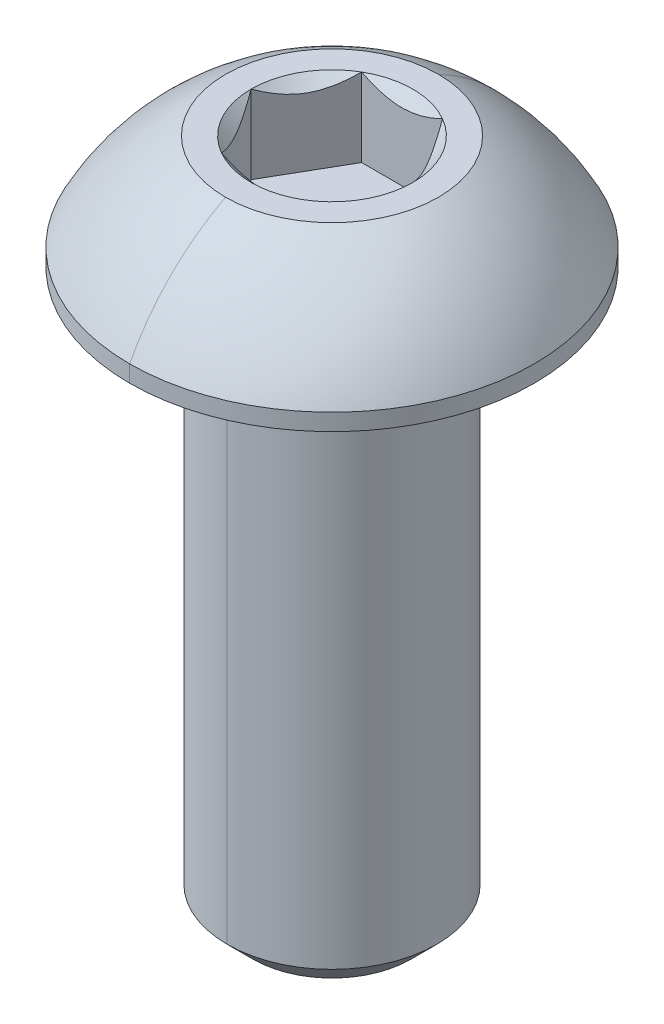
ISO-10303-21;
HEADER;
FILE_DESCRIPTION(('STEP AP214'),'2;1');
FILE_NAME('part.step','',(''),(''),'','','');
FILE_SCHEMA(('AUTOMOTIVE_DESIGN { 1 0 10303 214 1 1 1 1 }'));
ENDSEC;
DATA;
#1=APPLICATION_CONTEXT('core data for automotive mechanical design processes');
#2=APPLICATION_PROTOCOL_DEFINITION('international standard','automotive_design',2000,#1);
#3=PRODUCT_CONTEXT('',#1,'mechanical');
#4=PRODUCT('Part','Part','',(#3));
#5=PRODUCT_RELATED_PRODUCT_CATEGORY('part','',(#4));
#6=PRODUCT_DEFINITION_FORMATION('','',#4);
#7=PRODUCT_DEFINITION_CONTEXT('part definition',#1,'design');
#8=PRODUCT_DEFINITION('design','',#6,#7);
#9=PRODUCT_DEFINITION_SHAPE('','',#8);
#10=(LENGTH_UNIT() NAMED_UNIT(*) SI_UNIT(.MILLI.,.METRE.));
#11=(NAMED_UNIT(*) PLANE_ANGLE_UNIT() SI_UNIT($,.RADIAN.));
#12=(NAMED_UNIT(*) SI_UNIT($,.STERADIAN.) SOLID_ANGLE_UNIT());
#13=UNCERTAINTY_MEASURE_WITH_UNIT(LENGTH_MEASURE(1.E-05),#10,'distance_accuracy_value','');
#14=(GEOMETRIC_REPRESENTATION_CONTEXT(3) GLOBAL_UNCERTAINTY_ASSIGNED_CONTEXT((#13)) GLOBAL_UNIT_ASSIGNED_CONTEXT((#10,
#11,#12)) REPRESENTATION_CONTEXT('',''));
#15=CARTESIAN_POINT('',(0.,0.,0.));
#16=DIRECTION('',(0.,0.,1.));
#17=DIRECTION('',(1.,0.,0.));
#18=AXIS2_PLACEMENT_3D('',#15,#16,#17);
#19=CARTESIAN_POINT('',(0.,-0.1524,0.));
#20=DIRECTION('',(0.,1.,0.));
#21=DIRECTION('',(0.,0.,1.));
#22=AXIS2_PLACEMENT_3D('',#19,#20,#21);
#23=TOROIDAL_SURFACE('',#22,2.5273,0.1524);
#24=CARTESIAN_POINT('',(0.,-0.1524,-2.5273));
#25=DIRECTION('',(1.,0.,0.));
#26=DIRECTION('',(0.,0.,-1.));
#27=AXIS2_PLACEMENT_3D('',#24,#25,#26);
#28=CIRCLE('',#27,0.1524);
#29=CARTESIAN_POINT('',(0.,0.,-2.5273));
#30=VERTEX_POINT('',#29);
#31=CARTESIAN_POINT('',(0.,-0.1524,-2.3749));
#32=VERTEX_POINT('',#31);
#33=EDGE_CURVE('E328',#30,#32,#28,.T.);
#34=ORIENTED_EDGE('',*,*,#33,.F.);
#35=CARTESIAN_POINT('',(0.,0.,0.));
#36=DIRECTION('',(0.,1.,0.));
#37=DIRECTION('',(0.,0.,1.));
#38=AXIS2_PLACEMENT_3D('',#35,#36,#37);
#39=CIRCLE('',#38,2.5273);
#40=CARTESIAN_POINT('',(0.,0.,2.5273));
#41=VERTEX_POINT('',#40);
#42=EDGE_CURVE('E325',#41,#30,#39,.T.);
#43=ORIENTED_EDGE('',*,*,#42,.F.);
#44=CARTESIAN_POINT('',(0.,-0.1524,2.5273));
#45=DIRECTION('',(-1.,0.,0.));
#46=DIRECTION('',(0.,0.,1.));
#47=AXIS2_PLACEMENT_3D('',#44,#45,#46);
#48=CIRCLE('',#47,0.1524);
#49=CARTESIAN_POINT('',(0.,-0.1524,2.3749));
#50=VERTEX_POINT('',#49);
#51=EDGE_CURVE('E310',#41,#50,#48,.T.);
#52=ORIENTED_EDGE('',*,*,#51,.T.);
#53=CARTESIAN_POINT('',(0.,-0.1524,0.));
#54=DIRECTION('',(0.,-1.,0.));
#55=DIRECTION('',(0.,0.,1.));
#56=AXIS2_PLACEMENT_3D('',#53,#54,#55);
#57=CIRCLE('',#56,2.3749);
#58=EDGE_CURVE('E305',#32,#50,#57,.T.);
#59=ORIENTED_EDGE('',*,*,#58,.F.);
#60=EDGE_LOOP('',(#34,#43,#52,#59));
#61=FACE_BOUND('',#60,.T.);
#62=ADVANCED_FACE('F16',(#61),#23,.F.);
#63=CARTESIAN_POINT('',(0.,2.5654,0.));
#64=DIRECTION('',(0.,1.,0.));
#65=DIRECTION('',(0.,0.,1.));
#66=AXIS2_PLACEMENT_3D('',#63,#64,#65);
#67=CONICAL_SURFACE('',#66,1.83308710467706,0.78539816339745);
#68=DIRECTION('',(0.,0.707106781186546,-0.707106781186549));
#69=VECTOR('',#68,1.);
#70=CARTESIAN_POINT('',(0.,2.5654,-1.83308710467706));
#71=LINE('',#70,#69);
#72=CARTESIAN_POINT('',(0.,0.732312895322944,0.));
#73=VERTEX_POINT('',#72);
#74=CARTESIAN_POINT('',(0.,0.7874,-0.0550871046770556));
#75=VERTEX_POINT('',#74);
#76=EDGE_CURVE('E134',#73,#75,#71,.T.);
#77=ORIENTED_EDGE('',*,*,#76,.F.);
#78=DIRECTION('',(0.,0.707106781186546,0.707106781186549));
#79=VECTOR('',#78,1.);
#80=CARTESIAN_POINT('',(0.,2.5654,1.83308710467706));
#81=LINE('',#80,#79);
#82=CARTESIAN_POINT('',(0.,0.7874,0.0550871046770556));
#83=VERTEX_POINT('',#82);
#84=EDGE_CURVE('E277',#73,#83,#81,.T.);
#85=ORIENTED_EDGE('',*,*,#84,.T.);
#86=CARTESIAN_POINT('',(0.,0.7874,0.));
#87=DIRECTION('',(0.,1.,0.));
#88=DIRECTION('',(0.,0.,1.));
#89=AXIS2_PLACEMENT_3D('',#86,#87,#88);
#90=CIRCLE('',#89,0.0550871046770558);
#91=EDGE_CURVE('E114',#83,#75,#90,.T.);
#92=ORIENTED_EDGE('',*,*,#91,.T.);
#93=EDGE_LOOP('',(#77,#85,#92));
#94=FACE_BOUND('',#93,.T.);
#95=ADVANCED_FACE('F224',(#94),#67,.F.);
#96=CARTESIAN_POINT('',(1.83308710467706,0.7874,0.));
#97=DIRECTION('',(0.866025403784439,0.,-0.5));
#98=DIRECTION('',(0.,-1.,0.));
#99=AXIS2_PLACEMENT_3D('',#96,#97,#98);
#100=PLANE('',#99);
#101=DIRECTION('',(0.,1.,0.));
#102=VECTOR('',#101,1.);
#103=CARTESIAN_POINT('',(1.83308710467706,0.7874,0.));
#104=LINE('',#103,#102);
#105=CARTESIAN_POINT('',(1.83308710467706,0.7874,0.));
#106=VERTEX_POINT('',#105);
#107=CARTESIAN_POINT('',(1.83308710467706,2.5654,0.));
#108=VERTEX_POINT('',#107);
#109=EDGE_CURVE('E11',#106,#108,#104,.T.);
#110=ORIENTED_EDGE('',*,*,#109,.T.);
#111=CARTESIAN_POINT('',(1.83308710467706,2.5654,0.));
#112=CARTESIAN_POINT('',(1.58854939316106,2.32086228848399,-0.423551740712339));
#113=CARTESIAN_POINT('',(1.37650342717985,2.31981648546325,-0.790826127331817));
#114=CARTESIAN_POINT('',(1.16317917435944,2.31876437797812,-1.16031457170343));
#115=CARTESIAN_POINT('',(0.91654355233853,2.5654,-1.5875));
#116=B_SPLINE_CURVE_WITH_KNOTS('',2,(#111,#112,#113,#114,#115),.UNSPECIFIED.,.F.,.F.,(3,2,3),
(0.,0.5,1.),.UNSPECIFIED.);
#117=CARTESIAN_POINT('',(0.916543552338531,2.5654,-1.5875));
#118=VERTEX_POINT('',#117);
#119=EDGE_CURVE('E206',#108,#118,#116,.T.);
#120=ORIENTED_EDGE('',*,*,#119,.T.);
#121=DIRECTION('',(0.,1.,0.));
#122=VECTOR('',#121,1.);
#123=CARTESIAN_POINT('',(0.916543552338531,0.7874,-1.5875));
#124=LINE('',#123,#122);
#125=CARTESIAN_POINT('',(0.916543552338531,0.7874,-1.5875));
#126=VERTEX_POINT('',#125);
#127=EDGE_CURVE('E513',#126,#118,#124,.T.);
#128=ORIENTED_EDGE('',*,*,#127,.F.);
#129=DIRECTION('',(-0.5,0.,-0.866025403784439));
#130=VECTOR('',#129,1.);
#131=CARTESIAN_POINT('',(1.83308710467706,0.7874,0.));
#132=LINE('',#131,#130);
#133=EDGE_CURVE('E364',#106,#126,#132,.T.);
#134=ORIENTED_EDGE('',*,*,#133,.F.);
#135=EDGE_LOOP('',(#110,#120,#128,#134));
#136=FACE_BOUND('',#135,.T.);
#137=ADVANCED_FACE('F213',(#136),#100,.F.);
#138=CARTESIAN_POINT('',(0.916543552338531,0.7874,1.5875));
#139=DIRECTION('',(0.866025403784439,0.,0.5));
#140=DIRECTION('',(0.,-1.,0.));
#141=AXIS2_PLACEMENT_3D('',#138,#139,#140);
#142=PLANE('',#141);
#143=DIRECTION('',(0.,1.,0.));
#144=VECTOR('',#143,1.);
#145=CARTESIAN_POINT('',(0.916543552338531,0.7874,1.5875));
#146=LINE('',#145,#144);
#147=CARTESIAN_POINT('',(0.916543552338531,0.7874,1.5875));
#148=VERTEX_POINT('',#147);
#149=CARTESIAN_POINT('',(0.916543552338531,2.5654,1.5875));
#150=VERTEX_POINT('',#149);
#151=EDGE_CURVE('E30',#148,#150,#146,.T.);
#152=ORIENTED_EDGE('',*,*,#151,.T.);
#153=CARTESIAN_POINT('',(0.916543552338531,2.5654,1.5875));
#154=CARTESIAN_POINT('',(1.16108126385472,2.32086228848382,1.16394825928734));
#155=CARTESIAN_POINT('',(1.37312722983574,2.31981648546325,0.796673872668184));
#156=CARTESIAN_POINT('',(1.58645148265633,2.3187643779783,0.427185428296259));
#157=CARTESIAN_POINT('',(1.83308710467706,2.5654,0.));
#158=B_SPLINE_CURVE_WITH_KNOTS('',2,(#153,#154,#155,#156,#157),.UNSPECIFIED.,.F.,.F.,(3,2,3),
(0.,0.5,1.),.UNSPECIFIED.);
#159=EDGE_CURVE('E464',#150,#108,#158,.T.);
#160=ORIENTED_EDGE('',*,*,#159,.T.);
#161=ORIENTED_EDGE('',*,*,#109,.F.);
#162=DIRECTION('',(0.5,0.,-0.866025403784439));
#163=VECTOR('',#162,1.);
#164=CARTESIAN_POINT('',(0.916543552338531,0.7874,1.5875));
#165=LINE('',#164,#163);
#166=EDGE_CURVE('E199',#148,#106,#165,.T.);
#167=ORIENTED_EDGE('',*,*,#166,.F.);
#168=EDGE_LOOP('',(#152,#160,#161,#167));
#169=FACE_BOUND('',#168,.T.);
#170=ADVANCED_FACE('F223',(#169),#142,.F.);
#171=CARTESIAN_POINT('',(-0.91654355233853,0.7874,1.5875));
#172=DIRECTION('',(0.,0.,1.));
#173=DIRECTION('',(1.,0.,0.));
#174=AXIS2_PLACEMENT_3D('',#171,#172,#173);
#175=PLANE('',#174);
#176=DIRECTION('',(0.,1.,0.));
#177=VECTOR('',#176,1.);
#178=CARTESIAN_POINT('',(-0.91654355233853,0.7874,1.5875));
#179=LINE('',#178,#177);
#180=CARTESIAN_POINT('',(-0.91654355233853,0.7874,1.5875));
#181=VERTEX_POINT('',#180);
#182=CARTESIAN_POINT('',(-0.91654355233853,2.5654,1.5875));
#183=VERTEX_POINT('',#182);
#184=EDGE_CURVE('E606',#181,#183,#179,.T.);
#185=ORIENTED_EDGE('',*,*,#184,.T.);
#186=CARTESIAN_POINT('',(-0.916543552338531,2.5654,1.5875));
#187=CARTESIAN_POINT('',(-0.684381010738564,2.44931872920002,1.5875));
#188=CARTESIAN_POINT('',(-0.4718738638875,2.38845938444161,1.5875));
#189=CARTESIAN_POINT('',(-0.232175759974894,2.31981289532294,1.5875));
#190=CARTESIAN_POINT('',(0.,2.31981289532294,1.5875));
#191=B_SPLINE_CURVE_WITH_KNOTS('',2,(#186,#187,#188,#189,#190),.UNSPECIFIED.,.F.,.F.,(3,2,3),
(0.,0.5,1.),.UNSPECIFIED.);
#192=CARTESIAN_POINT('',(0.,2.31981289532294,1.5875));
#193=VERTEX_POINT('',#192);
#194=EDGE_CURVE('E661',#183,#193,#191,.T.);
#195=ORIENTED_EDGE('',*,*,#194,.T.);
#196=CARTESIAN_POINT('',(0.,2.31981289532294,1.5875));
#197=CARTESIAN_POINT('',(0.229732695645398,2.31981289532294,1.5875));
#198=CARTESIAN_POINT('',(0.471961624215038,2.3884843914945,1.5875));
#199=CARTESIAN_POINT('',(0.68154594324368,2.44790119545257,1.5875));
#200=CARTESIAN_POINT('',(0.91654355233853,2.5654,1.5875));
#201=B_SPLINE_CURVE_WITH_KNOTS('',2,(#196,#197,#198,#199,#200),.UNSPECIFIED.,.F.,.F.,(3,2,3),
(0.,0.5,1.),.UNSPECIFIED.);
#202=EDGE_CURVE('E249',#193,#150,#201,.T.);
#203=ORIENTED_EDGE('',*,*,#202,.T.);
#204=ORIENTED_EDGE('',*,*,#151,.F.);
#205=DIRECTION('',(1.,0.,0.));
#206=VECTOR('',#205,1.);
#207=CARTESIAN_POINT('',(-0.91654355233853,0.7874,1.5875));
#208=LINE('',#207,#206);
#209=EDGE_CURVE('E282',#181,#148,#208,.T.);
#210=ORIENTED_EDGE('',*,*,#209,.F.);
#211=EDGE_LOOP('',(#185,#195,#203,#204,#210));
#212=FACE_BOUND('',#211,.T.);
#213=ADVANCED_FACE('F18',(#212),#175,.F.);
#214=CARTESIAN_POINT('',(-1.83308710467706,0.7874,0.));
#215=DIRECTION('',(-0.866025403784439,0.,0.5));
#216=DIRECTION('',(0.,1.,0.));
#217=AXIS2_PLACEMENT_3D('',#214,#215,#216);
#218=PLANE('',#217);
#219=DIRECTION('',(0.,1.,0.));
#220=VECTOR('',#219,1.);
#221=CARTESIAN_POINT('',(-1.83308710467706,0.7874,0.));
#222=LINE('',#221,#220);
#223=CARTESIAN_POINT('',(-1.83308710467706,0.7874,0.));
#224=VERTEX_POINT('',#223);
#225=CARTESIAN_POINT('',(-1.83308710467706,2.5654,0.));
#226=VERTEX_POINT('',#225);
#227=EDGE_CURVE('E576',#224,#226,#222,.T.);
#228=ORIENTED_EDGE('',*,*,#227,.T.);
#229=CARTESIAN_POINT('',(-1.83308710467706,2.5654,0.));
#230=CARTESIAN_POINT('',(-1.58854939316106,2.32086228848399,0.423551740712331));
#231=CARTESIAN_POINT('',(-1.37650342717985,2.31981648546325,0.790826127331817));
#232=CARTESIAN_POINT('',(-1.16317917435944,2.31876437797812,1.16031457170343));
#233=CARTESIAN_POINT('',(-0.91654355233853,2.5654,1.5875));
#234=B_SPLINE_CURVE_WITH_KNOTS('',2,(#229,#230,#231,#232,#233),.UNSPECIFIED.,.F.,.F.,(3,2,3),
(0.,0.5,1.),.UNSPECIFIED.);
#235=EDGE_CURVE('E579',#226,#183,#234,.T.);
#236=ORIENTED_EDGE('',*,*,#235,.T.);
#237=ORIENTED_EDGE('',*,*,#184,.F.);
#238=DIRECTION('',(0.5,0.,0.866025403784438));
#239=VECTOR('',#238,1.);
#240=CARTESIAN_POINT('',(-1.83308710467706,0.7874,0.));
#241=LINE('',#240,#239);
#242=EDGE_CURVE('E285',#224,#181,#241,.T.);
#243=ORIENTED_EDGE('',*,*,#242,.F.);
#244=EDGE_LOOP('',(#228,#236,#237,#243));
#245=FACE_BOUND('',#244,.T.);
#246=ADVANCED_FACE('F233',(#245),#218,.F.);
#247=CARTESIAN_POINT('',(-0.916543552338531,0.7874,-1.5875));
#248=DIRECTION('',(-0.866025403784439,0.,-0.5));
#249=DIRECTION('',(-0.5,0.,0.866025403784439));
#250=AXIS2_PLACEMENT_3D('',#247,#248,#249);
#251=PLANE('',#250);
#252=DIRECTION('',(0.,1.,0.));
#253=VECTOR('',#252,1.);
#254=CARTESIAN_POINT('',(-0.916543552338531,0.7874,-1.5875));
#255=LINE('',#254,#253);
#256=CARTESIAN_POINT('',(-0.916543552338531,0.7874,-1.5875));
#257=VERTEX_POINT('',#256);
#258=CARTESIAN_POINT('',(-0.916543552338531,2.5654,-1.5875));
#259=VERTEX_POINT('',#258);
#260=EDGE_CURVE('E516',#257,#259,#255,.T.);
#261=ORIENTED_EDGE('',*,*,#260,.T.);
#262=CARTESIAN_POINT('',(-0.916543552338531,2.5654,-1.5875));
#263=CARTESIAN_POINT('',(-1.16108126385453,2.320862288484,-1.16394825928767));
#264=CARTESIAN_POINT('',(-1.37312722983574,2.31981648546325,-0.796673872668183));
#265=CARTESIAN_POINT('',(-1.58645148265615,2.31876437797813,-0.427185428296571));
#266=CARTESIAN_POINT('',(-1.83308710467706,2.5654,0.));
#267=B_SPLINE_CURVE_WITH_KNOTS('',2,(#262,#263,#264,#265,#266),.UNSPECIFIED.,.F.,.F.,(3,2,3),
(0.,0.5,1.),.UNSPECIFIED.);
#268=EDGE_CURVE('E543',#259,#226,#267,.T.);
#269=ORIENTED_EDGE('',*,*,#268,.T.);
#270=ORIENTED_EDGE('',*,*,#227,.F.);
#271=DIRECTION('',(-0.5,0.,0.866025403784439));
#272=VECTOR('',#271,1.);
#273=CARTESIAN_POINT('',(-0.916543552338531,0.7874,-1.5875));
#274=LINE('',#273,#272);
#275=EDGE_CURVE('E293',#257,#224,#274,.T.);
#276=ORIENTED_EDGE('',*,*,#275,.F.);
#277=EDGE_LOOP('',(#261,#269,#270,#276));
#278=FACE_BOUND('',#277,.T.);
#279=ADVANCED_FACE('F558',(#278),#251,.F.);
#280=CARTESIAN_POINT('',(0.916543552338531,0.7874,-1.5875));
#281=DIRECTION('',(0.,0.,-1.));
#282=DIRECTION('',(-1.,0.,0.));
#283=AXIS2_PLACEMENT_3D('',#280,#281,#282);
#284=PLANE('',#283);
#285=ORIENTED_EDGE('',*,*,#127,.T.);
#286=CARTESIAN_POINT('',(0.916543552338531,2.5654,-1.5875));
#287=CARTESIAN_POINT('',(0.68330023814449,2.44877834290298,-1.5875));
#288=CARTESIAN_POINT('',(0.472022049766507,2.38850161206546,-1.5875));
#289=CARTESIAN_POINT('',(0.231606862063275,2.31991222444484,-1.5875));
#290=CARTESIAN_POINT('',(0.000126990617285933,2.31981290040219,-1.5875));
#291=CARTESIAN_POINT('',(-0.230319895797069,2.3197140195957,-1.5875));
#292=CARTESIAN_POINT('',(-0.471813597713689,2.38844221424328,-1.5875));
#293=CARTESIAN_POINT('',(-0.682613944360854,2.44843519601116,-1.5875));
#294=CARTESIAN_POINT('',(-0.916543552338529,2.5654,-1.5875));
#295=B_SPLINE_CURVE_WITH_KNOTS('',2,(#286,#287,#288,#289,#290,#291,#292,#293,#294),
.UNSPECIFIED.,.F.,.F.,(3,2,2,2,3),(0.,0.25,0.5,0.75,1.),.UNSPECIFIED.);
#296=EDGE_CURVE('E526',#118,#259,#295,.T.);
#297=ORIENTED_EDGE('',*,*,#296,.T.);
#298=ORIENTED_EDGE('',*,*,#260,.F.);
#299=DIRECTION('',(-1.,0.,0.));
#300=VECTOR('',#299,1.);
#301=CARTESIAN_POINT('',(0.916543552338531,0.7874,-1.5875));
#302=LINE('',#301,#300);
#303=EDGE_CURVE('E300',#126,#257,#302,.T.);
#304=ORIENTED_EDGE('',*,*,#303,.F.);
#305=EDGE_LOOP('',(#285,#297,#298,#304));
#306=FACE_BOUND('',#305,.T.);
#307=ADVANCED_FACE('F566',(#306),#284,.F.);
#308=CARTESIAN_POINT('',(0.,0.7874,0.));
#309=DIRECTION('',(0.,1.,0.));
#310=DIRECTION('',(1.,0.,0.));
#311=AXIS2_PLACEMENT_3D('',#308,#309,#310);
#312=PLANE('',#311);
#313=ORIENTED_EDGE('',*,*,#91,.F.);
#314=CARTESIAN_POINT('',(0.,0.7874,0.));
#315=DIRECTION('',(0.,1.,0.));
#316=DIRECTION('',(0.,0.,1.));
#317=AXIS2_PLACEMENT_3D('',#314,#315,#316);
#318=CIRCLE('',#317,0.0550871046770558);
#319=EDGE_CURVE('E266',#75,#83,#318,.T.);
#320=ORIENTED_EDGE('',*,*,#319,.F.);
#321=EDGE_LOOP('',(#313,#320));
#322=FACE_BOUND('',#321,.T.);
#323=ORIENTED_EDGE('',*,*,#133,.T.);
#324=ORIENTED_EDGE('',*,*,#303,.T.);
#325=ORIENTED_EDGE('',*,*,#275,.T.);
#326=ORIENTED_EDGE('',*,*,#242,.T.);
#327=ORIENTED_EDGE('',*,*,#209,.T.);
#328=ORIENTED_EDGE('',*,*,#166,.T.);
#329=EDGE_LOOP('',(#323,#324,#325,#326,#327,#328));
#330=FACE_BOUND('',#329,.T.);
#331=ADVANCED_FACE('F422',(#322,#330),#312,.T.);
#332=CARTESIAN_POINT('',(0.,2.5654,0.));
#333=DIRECTION('',(0.,1.,0.));
#334=DIRECTION('',(0.,0.,1.));
#335=AXIS2_PLACEMENT_3D('',#332,#333,#334);
#336=CONICAL_SURFACE('',#335,1.83308710467706,0.78539816339745);
#337=CARTESIAN_POINT('',(0.,2.5654,0.));
#338=DIRECTION('',(0.,1.,0.));
#339=DIRECTION('',(0.,0.,1.));
#340=AXIS2_PLACEMENT_3D('',#337,#338,#339);
#341=CIRCLE('',#340,1.83308710467706);
#342=EDGE_CURVE('E505',#108,#118,#341,.T.);
#343=ORIENTED_EDGE('',*,*,#342,.T.);
#344=ORIENTED_EDGE('',*,*,#119,.F.);
#345=EDGE_LOOP('',(#343,#344));
#346=FACE_BOUND('',#345,.T.);
#347=ADVANCED_FACE('F482',(#346),#336,.F.);
#348=CARTESIAN_POINT('',(0.,2.5654,0.));
#349=DIRECTION('',(0.,1.,0.));
#350=DIRECTION('',(0.,0.,1.));
#351=AXIS2_PLACEMENT_3D('',#348,#349,#350);
#352=CONICAL_SURFACE('',#351,1.83308710467706,0.78539816339745);
#353=CARTESIAN_POINT('',(0.,2.5654,0.));
#354=DIRECTION('',(0.,1.,0.));
#355=DIRECTION('',(0.,0.,1.));
#356=AXIS2_PLACEMENT_3D('',#353,#354,#355);
#357=CIRCLE('',#356,1.83308710467706);
#358=EDGE_CURVE('E501',#150,#108,#357,.T.);
#359=ORIENTED_EDGE('',*,*,#358,.T.);
#360=ORIENTED_EDGE('',*,*,#159,.F.);
#361=EDGE_LOOP('',(#359,#360));
#362=FACE_BOUND('',#361,.T.);
#363=ADVANCED_FACE('F471',(#362),#352,.F.);
#364=CARTESIAN_POINT('',(0.,2.5654,0.));
#365=DIRECTION('',(0.,1.,0.));
#366=DIRECTION('',(0.,0.,1.));
#367=AXIS2_PLACEMENT_3D('',#364,#365,#366);
#368=CONICAL_SURFACE('',#367,1.83308710467706,0.78539816339745);
#369=DIRECTION('',(0.,0.707106781186546,0.707106781186549));
#370=VECTOR('',#369,1.);
#371=CARTESIAN_POINT('',(0.,2.5654,1.83308710467706));
#372=LINE('',#371,#370);
#373=CARTESIAN_POINT('',(0.,2.5654,1.83308710467706));
#374=VERTEX_POINT('',#373);
#375=EDGE_CURVE('E262',#193,#374,#372,.T.);
#376=ORIENTED_EDGE('',*,*,#375,.F.);
#377=ORIENTED_EDGE('',*,*,#194,.F.);
#378=CARTESIAN_POINT('',(0.,2.5654,0.));
#379=DIRECTION('',(0.,1.,0.));
#380=DIRECTION('',(0.,0.,1.));
#381=AXIS2_PLACEMENT_3D('',#378,#379,#380);
#382=CIRCLE('',#381,1.83308710467706);
#383=EDGE_CURVE('E504',#183,#374,#382,.T.);
#384=ORIENTED_EDGE('',*,*,#383,.T.);
#385=EDGE_LOOP('',(#376,#377,#384));
#386=FACE_BOUND('',#385,.T.);
#387=ADVANCED_FACE('F481',(#386),#368,.F.);
#388=CARTESIAN_POINT('',(0.,2.5654,0.));
#389=DIRECTION('',(0.,1.,0.));
#390=DIRECTION('',(0.,0.,1.));
#391=AXIS2_PLACEMENT_3D('',#388,#389,#390);
#392=CONICAL_SURFACE('',#391,1.83308710467706,0.78539816339745);
#393=CARTESIAN_POINT('',(0.,2.5654,0.));
#394=DIRECTION('',(0.,1.,0.));
#395=DIRECTION('',(0.,0.,1.));
#396=AXIS2_PLACEMENT_3D('',#393,#394,#395);
#397=CIRCLE('',#396,1.83308710467706);
#398=EDGE_CURVE('E534',#226,#183,#397,.T.);
#399=ORIENTED_EDGE('',*,*,#398,.T.);
#400=ORIENTED_EDGE('',*,*,#235,.F.);
#401=EDGE_LOOP('',(#399,#400));
#402=FACE_BOUND('',#401,.T.);
#403=ADVANCED_FACE('F596',(#402),#392,.F.);
#404=CARTESIAN_POINT('',(0.,2.5654,0.));
#405=DIRECTION('',(0.,1.,0.));
#406=DIRECTION('',(0.,0.,1.));
#407=AXIS2_PLACEMENT_3D('',#404,#405,#406);
#408=CONICAL_SURFACE('',#407,1.83308710467706,0.78539816339745);
#409=CARTESIAN_POINT('',(0.,2.5654,0.));
#410=DIRECTION('',(0.,1.,0.));
#411=DIRECTION('',(0.,0.,1.));
#412=AXIS2_PLACEMENT_3D('',#409,#410,#411);
#413=CIRCLE('',#412,1.83308710467706);
#414=EDGE_CURVE('E531',#259,#226,#413,.T.);
#415=ORIENTED_EDGE('',*,*,#414,.T.);
#416=ORIENTED_EDGE('',*,*,#268,.F.);
#417=EDGE_LOOP('',(#415,#416));
#418=FACE_BOUND('',#417,.T.);
#419=ADVANCED_FACE('F231',(#418),#408,.F.);
#420=CARTESIAN_POINT('',(0.,2.5654,0.));
#421=DIRECTION('',(0.,1.,0.));
#422=DIRECTION('',(0.,0.,1.));
#423=AXIS2_PLACEMENT_3D('',#420,#421,#422);
#424=CONICAL_SURFACE('',#423,1.83308710467706,0.78539816339745);
#425=CARTESIAN_POINT('',(0.,2.5654,0.));
#426=DIRECTION('',(0.,1.,0.));
#427=DIRECTION('',(0.,0.,1.));
#428=AXIS2_PLACEMENT_3D('',#425,#426,#427);
#429=CIRCLE('',#428,1.83308710467706);
#430=EDGE_CURVE('E174',#118,#259,#429,.T.);
#431=ORIENTED_EDGE('',*,*,#430,.T.);
#432=ORIENTED_EDGE('',*,*,#296,.F.);
#433=EDGE_LOOP('',(#431,#432));
#434=FACE_BOUND('',#433,.T.);
#435=ADVANCED_FACE('F227',(#434),#424,.F.);
#436=CARTESIAN_POINT('',(0.,2.5654,-2.413));
#437=DIRECTION('',(0.,-1.,0.));
#438=DIRECTION('',(0.,0.,-1.));
#439=AXIS2_PLACEMENT_3D('',#436,#437,#438);
#440=PLANE('',#439);
#441=ORIENTED_EDGE('',*,*,#430,.F.);
#442=ORIENTED_EDGE('',*,*,#342,.F.);
#443=ORIENTED_EDGE('',*,*,#358,.F.);
#444=CARTESIAN_POINT('',(0.,2.5654,0.));
#445=DIRECTION('',(0.,1.,0.));
#446=DIRECTION('',(0.,0.,1.));
#447=AXIS2_PLACEMENT_3D('',#444,#445,#446);
#448=CIRCLE('',#447,1.83308710467706);
#449=EDGE_CURVE('E264',#374,#150,#448,.T.);
#450=ORIENTED_EDGE('',*,*,#449,.F.);
#451=ORIENTED_EDGE('',*,*,#383,.F.);
#452=ORIENTED_EDGE('',*,*,#398,.F.);
#453=ORIENTED_EDGE('',*,*,#414,.F.);
#454=EDGE_LOOP('',(#441,#442,#443,#450,#451,#452,#453));
#455=FACE_BOUND('',#454,.T.);
#456=CARTESIAN_POINT('',(0.,2.5654,0.));
#457=DIRECTION('',(0.,1.,0.));
#458=DIRECTION('',(0.,0.,1.));
#459=AXIS2_PLACEMENT_3D('',#456,#457,#458);
#460=CIRCLE('',#459,2.413);
#461=CARTESIAN_POINT('',(0.,2.5654,2.413));
#462=VERTEX_POINT('',#461);
#463=CARTESIAN_POINT('',(0.,2.5654,-2.413));
#464=VERTEX_POINT('',#463);
#465=EDGE_CURVE('E169',#462,#464,#460,.T.);
#466=ORIENTED_EDGE('',*,*,#465,.T.);
#467=CARTESIAN_POINT('',(0.,2.5654,0.));
#468=DIRECTION('',(0.,1.,0.));
#469=DIRECTION('',(0.,0.,1.));
#470=AXIS2_PLACEMENT_3D('',#467,#468,#469);
#471=CIRCLE('',#470,2.413);
#472=EDGE_CURVE('E165',#464,#462,#471,.T.);
#473=ORIENTED_EDGE('',*,*,#472,.T.);
#474=EDGE_LOOP('',(#466,#473));
#475=FACE_BOUND('',#474,.T.);
#476=ADVANCED_FACE('F167',(#455,#475),#440,.F.);
#477=CARTESIAN_POINT('',(0.,-1.9398474797777,0.));
#478=DIRECTION('',(0.,1.,0.));
#479=DIRECTION('',(0.,0.,1.));
#480=AXIS2_PLACEMENT_3D('',#477,#478,#479);
#481=DEGENERATE_TOROIDAL_SURFACE('',#480,0.065843178235288,5.08,.T.);
#482=CARTESIAN_POINT('',(0.,-1.9398474797777,-0.065843178235288));
#483=DIRECTION('',(1.,0.,0.));
#484=DIRECTION('',(0.,0.,-1.));
#485=AXIS2_PLACEMENT_3D('',#482,#483,#484);
#486=CIRCLE('',#485,5.08);
#487=CARTESIAN_POINT('',(0.,0.381,-4.5847));
#488=VERTEX_POINT('',#487);
#489=EDGE_CURVE('E189',#488,#464,#486,.T.);
#490=ORIENTED_EDGE('',*,*,#489,.F.);
#491=CARTESIAN_POINT('',(0.,0.381,0.));
#492=DIRECTION('',(0.,1.,0.));
#493=DIRECTION('',(0.,0.,1.));
#494=AXIS2_PLACEMENT_3D('',#491,#492,#493);
#495=CIRCLE('',#494,4.5847);
#496=CARTESIAN_POINT('',(0.,0.381,4.5847));
#497=VERTEX_POINT('',#496);
#498=EDGE_CURVE('E175',#488,#497,#495,.T.);
#499=ORIENTED_EDGE('',*,*,#498,.T.);
#500=CARTESIAN_POINT('',(0.,-1.9398474797777,0.065843178235288));
#501=DIRECTION('',(-1.,0.,0.));
#502=DIRECTION('',(0.,0.,1.));
#503=AXIS2_PLACEMENT_3D('',#500,#501,#502);
#504=CIRCLE('',#503,5.08);
#505=EDGE_CURVE('E179',#497,#462,#504,.T.);
#506=ORIENTED_EDGE('',*,*,#505,.T.);
#507=ORIENTED_EDGE('',*,*,#472,.F.);
#508=EDGE_LOOP('',(#490,#499,#506,#507));
#509=FACE_BOUND('',#508,.T.);
#510=ADVANCED_FACE('F180',(#509),#481,.T.);
#511=CARTESIAN_POINT('',(0.,2.5654,0.));
#512=DIRECTION('',(0.,1.,0.));
#513=DIRECTION('',(0.,0.,1.));
#514=AXIS2_PLACEMENT_3D('',#511,#512,#513);
#515=CYLINDRICAL_SURFACE('',#514,4.5847);
#516=DIRECTION('',(0.,1.,0.));
#517=VECTOR('',#516,1.);
#518=CARTESIAN_POINT('',(0.,2.5654,-4.5847));
#519=LINE('',#518,#517);
#520=CARTESIAN_POINT('',(0.,0.,-4.5847));
#521=VERTEX_POINT('',#520);
#522=EDGE_CURVE('E318',#521,#488,#519,.T.);
#523=ORIENTED_EDGE('',*,*,#522,.F.);
#524=CARTESIAN_POINT('',(0.,0.,0.));
#525=DIRECTION('',(0.,1.,0.));
#526=DIRECTION('',(0.,0.,1.));
#527=AXIS2_PLACEMENT_3D('',#524,#525,#526);
#528=CIRCLE('',#527,4.5847);
#529=CARTESIAN_POINT('',(0.,0.,4.5847));
#530=VERTEX_POINT('',#529);
#531=EDGE_CURVE('E356',#521,#530,#528,.T.);
#532=ORIENTED_EDGE('',*,*,#531,.T.);
#533=DIRECTION('',(0.,1.,0.));
#534=VECTOR('',#533,1.);
#535=CARTESIAN_POINT('',(0.,2.5654,4.5847));
#536=LINE('',#535,#534);
#537=EDGE_CURVE('E349',#530,#497,#536,.T.);
#538=ORIENTED_EDGE('',*,*,#537,.T.);
#539=ORIENTED_EDGE('',*,*,#498,.F.);
#540=EDGE_LOOP('',(#523,#532,#538,#539));
#541=FACE_BOUND('',#540,.T.);
#542=ADVANCED_FACE('F427',(#541),#515,.T.);
#543=CARTESIAN_POINT('',(0.,0.,0.));
#544=DIRECTION('',(0.,1.,0.));
#545=DIRECTION('',(1.,0.,0.));
#546=AXIS2_PLACEMENT_3D('',#543,#544,#545);
#547=PLANE('',#546);
#548=ORIENTED_EDGE('',*,*,#42,.T.);
#549=CARTESIAN_POINT('',(0.,0.,0.));
#550=DIRECTION('',(0.,1.,0.));
#551=DIRECTION('',(0.,0.,1.));
#552=AXIS2_PLACEMENT_3D('',#549,#550,#551);
#553=CIRCLE('',#552,2.5273);
#554=EDGE_CURVE('E336',#30,#41,#553,.T.);
#555=ORIENTED_EDGE('',*,*,#554,.T.);
#556=EDGE_LOOP('',(#548,#555));
#557=FACE_BOUND('',#556,.T.);
#558=CARTESIAN_POINT('',(0.,0.,0.));
#559=DIRECTION('',(0.,1.,0.));
#560=DIRECTION('',(0.,0.,1.));
#561=AXIS2_PLACEMENT_3D('',#558,#559,#560);
#562=CIRCLE('',#561,4.5847);
#563=EDGE_CURVE('E186',#530,#521,#562,.T.);
#564=ORIENTED_EDGE('',*,*,#563,.F.);
#565=ORIENTED_EDGE('',*,*,#531,.F.);
#566=EDGE_LOOP('',(#564,#565));
#567=FACE_BOUND('',#566,.T.);
#568=ADVANCED_FACE('F430',(#557,#567),#547,.F.);
#569=CARTESIAN_POINT('',(0.,-12.1158,0.));
#570=DIRECTION('',(0.,1.,0.));
#571=DIRECTION('',(0.,0.,1.));
#572=AXIS2_PLACEMENT_3D('',#569,#570,#571);
#573=CONICAL_SURFACE('',#572,2.3749,0.785398163397449);
#574=DIRECTION('',(0.,0.707106781186547,-0.707106781186548));
#575=VECTOR('',#574,1.);
#576=CARTESIAN_POINT('',(0.,-12.1158,-2.3749));
#577=LINE('',#576,#575);
#578=CARTESIAN_POINT('',(0.,-12.7,-1.7907));
#579=VERTEX_POINT('',#578);
#580=CARTESIAN_POINT('',(0.,-12.1158,-2.3749));
#581=VERTEX_POINT('',#580);
#582=EDGE_CURVE('E363',#579,#581,#577,.T.);
#583=ORIENTED_EDGE('',*,*,#582,.F.);
#584=CARTESIAN_POINT('',(0.,-12.7,0.));
#585=DIRECTION('',(0.,-1.,0.));
#586=DIRECTION('',(0.,0.,1.));
#587=AXIS2_PLACEMENT_3D('',#584,#585,#586);
#588=CIRCLE('',#587,1.7907);
#589=CARTESIAN_POINT('',(0.,-12.7,1.7907));
#590=VERTEX_POINT('',#589);
#591=EDGE_CURVE('E353',#590,#579,#588,.T.);
#592=ORIENTED_EDGE('',*,*,#591,.F.);
#593=DIRECTION('',(0.,0.707106781186547,0.707106781186548));
#594=VECTOR('',#593,1.);
#595=CARTESIAN_POINT('',(0.,-12.1158,2.3749));
#596=LINE('',#595,#594);
#597=CARTESIAN_POINT('',(0.,-12.1158,2.3749));
#598=VERTEX_POINT('',#597);
#599=EDGE_CURVE('E319',#590,#598,#596,.T.);
#600=ORIENTED_EDGE('',*,*,#599,.T.);
#601=CARTESIAN_POINT('',(0.,-12.1158,0.));
#602=DIRECTION('',(0.,1.,0.));
#603=DIRECTION('',(0.,0.,1.));
#604=AXIS2_PLACEMENT_3D('',#601,#602,#603);
#605=CIRCLE('',#604,2.3749);
#606=EDGE_CURVE('E357',#581,#598,#605,.T.);
#607=ORIENTED_EDGE('',*,*,#606,.F.);
#608=EDGE_LOOP('',(#583,#592,#600,#607));
#609=FACE_BOUND('',#608,.T.);
#610=ADVANCED_FACE('F225',(#609),#573,.T.);
#611=CARTESIAN_POINT('',(0.,-12.7,0.));
#612=DIRECTION('',(0.,1.,0.));
#613=DIRECTION('',(1.,0.,0.));
#614=AXIS2_PLACEMENT_3D('',#611,#612,#613);
#615=PLANE('',#614);
#616=ORIENTED_EDGE('',*,*,#591,.T.);
#617=CARTESIAN_POINT('',(0.,-12.7,0.));
#618=DIRECTION('',(0.,-1.,0.));
#619=DIRECTION('',(0.,0.,1.));
#620=AXIS2_PLACEMENT_3D('',#617,#618,#619);
#621=CIRCLE('',#620,1.7907);
#622=EDGE_CURVE('E352',#579,#590,#621,.T.);
#623=ORIENTED_EDGE('',*,*,#622,.T.);
#624=EDGE_LOOP('',(#616,#623));
#625=FACE_BOUND('',#624,.T.);
#626=ADVANCED_FACE('F484',(#625),#615,.F.);
#627=CARTESIAN_POINT('',(0.,-12.7,0.));
#628=DIRECTION('',(0.,1.,0.));
#629=DIRECTION('',(0.,0.,1.));
#630=AXIS2_PLACEMENT_3D('',#627,#628,#629);
#631=CYLINDRICAL_SURFACE('',#630,2.3749);
#632=DIRECTION('',(0.,1.,0.));
#633=VECTOR('',#632,1.);
#634=CARTESIAN_POINT('',(0.,-12.7,-2.3749));
#635=LINE('',#634,#633);
#636=EDGE_CURVE('E280',#581,#32,#635,.T.);
#637=ORIENTED_EDGE('',*,*,#636,.F.);
#638=ORIENTED_EDGE('',*,*,#606,.T.);
#639=DIRECTION('',(0.,1.,0.));
#640=VECTOR('',#639,1.);
#641=CARTESIAN_POINT('',(0.,-12.7,2.3749));
#642=LINE('',#641,#640);
#643=EDGE_CURVE('E309',#598,#50,#642,.T.);
#644=ORIENTED_EDGE('',*,*,#643,.T.);
#645=CARTESIAN_POINT('',(0.,-0.1524,0.));
#646=DIRECTION('',(0.,-1.,0.));
#647=DIRECTION('',(0.,0.,1.));
#648=AXIS2_PLACEMENT_3D('',#645,#646,#647);
#649=CIRCLE('',#648,2.3749);
#650=EDGE_CURVE('E314',#50,#32,#649,.T.);
#651=ORIENTED_EDGE('',*,*,#650,.T.);
#652=EDGE_LOOP('',(#637,#638,#644,#651));
#653=FACE_BOUND('',#652,.T.);
#654=ADVANCED_FACE('F398',(#653),#631,.T.);
#655=CARTESIAN_POINT('',(0.,-12.7,0.));
#656=DIRECTION('',(0.,1.,0.));
#657=DIRECTION('',(0.,0.,1.));
#658=AXIS2_PLACEMENT_3D('',#655,#656,#657);
#659=CYLINDRICAL_SURFACE('',#658,2.3749);
#660=CARTESIAN_POINT('',(0.,-12.1158,0.));
#661=DIRECTION('',(0.,1.,0.));
#662=DIRECTION('',(0.,0.,1.));
#663=AXIS2_PLACEMENT_3D('',#660,#661,#662);
#664=CIRCLE('',#663,2.3749);
#665=EDGE_CURVE('E323',#598,#581,#664,.T.);
#666=ORIENTED_EDGE('',*,*,#665,.T.);
#667=ORIENTED_EDGE('',*,*,#636,.T.);
#668=ORIENTED_EDGE('',*,*,#58,.T.);
#669=ORIENTED_EDGE('',*,*,#643,.F.);
#670=EDGE_LOOP('',(#666,#667,#668,#669));
#671=FACE_BOUND('',#670,.T.);
#672=ADVANCED_FACE('F400',(#671),#659,.T.);
#673=CARTESIAN_POINT('',(0.,-12.1158,0.));
#674=DIRECTION('',(0.,1.,0.));
#675=DIRECTION('',(0.,0.,1.));
#676=AXIS2_PLACEMENT_3D('',#673,#674,#675);
#677=CONICAL_SURFACE('',#676,2.3749,0.785398163397449);
#678=ORIENTED_EDGE('',*,*,#622,.F.);
#679=ORIENTED_EDGE('',*,*,#582,.T.);
#680=ORIENTED_EDGE('',*,*,#665,.F.);
#681=ORIENTED_EDGE('',*,*,#599,.F.);
#682=EDGE_LOOP('',(#678,#679,#680,#681));
#683=FACE_BOUND('',#682,.T.);
#684=ADVANCED_FACE('F402',(#683),#677,.T.);
#685=CARTESIAN_POINT('',(0.,2.5654,0.));
#686=DIRECTION('',(0.,1.,0.));
#687=DIRECTION('',(0.,0.,1.));
#688=AXIS2_PLACEMENT_3D('',#685,#686,#687);
#689=CYLINDRICAL_SURFACE('',#688,4.5847);
#690=ORIENTED_EDGE('',*,*,#563,.T.);
#691=ORIENTED_EDGE('',*,*,#522,.T.);
#692=CARTESIAN_POINT('',(0.,0.381,0.));
#693=DIRECTION('',(0.,1.,0.));
#694=DIRECTION('',(0.,0.,1.));
#695=AXIS2_PLACEMENT_3D('',#692,#693,#694);
#696=CIRCLE('',#695,4.5847);
#697=EDGE_CURVE('E196',#497,#488,#696,.T.);
#698=ORIENTED_EDGE('',*,*,#697,.F.);
#699=ORIENTED_EDGE('',*,*,#537,.F.);
#700=EDGE_LOOP('',(#690,#691,#698,#699));
#701=FACE_BOUND('',#700,.T.);
#702=ADVANCED_FACE('F404',(#701),#689,.T.);
#703=CARTESIAN_POINT('',(0.,-1.9398474797777,0.));
#704=DIRECTION('',(0.,1.,0.));
#705=DIRECTION('',(0.,0.,1.));
#706=AXIS2_PLACEMENT_3D('',#703,#704,#705);
#707=DEGENERATE_TOROIDAL_SURFACE('',#706,0.065843178235288,5.08,.T.);
#708=ORIENTED_EDGE('',*,*,#697,.T.);
#709=ORIENTED_EDGE('',*,*,#489,.T.);
#710=ORIENTED_EDGE('',*,*,#465,.F.);
#711=ORIENTED_EDGE('',*,*,#505,.F.);
#712=EDGE_LOOP('',(#708,#709,#710,#711));
#713=FACE_BOUND('',#712,.T.);
#714=ADVANCED_FACE('F188',(#713),#707,.T.);
#715=CARTESIAN_POINT('',(0.,2.5654,0.));
#716=DIRECTION('',(0.,1.,0.));
#717=DIRECTION('',(0.,0.,1.));
#718=AXIS2_PLACEMENT_3D('',#715,#716,#717);
#719=CONICAL_SURFACE('',#718,1.83308710467706,0.78539816339745);
#720=ORIENTED_EDGE('',*,*,#202,.F.);
#721=ORIENTED_EDGE('',*,*,#375,.T.);
#722=ORIENTED_EDGE('',*,*,#449,.T.);
#723=EDGE_LOOP('',(#720,#721,#722));
#724=FACE_BOUND('',#723,.T.);
#725=ADVANCED_FACE('F260',(#724),#719,.F.);
#726=CARTESIAN_POINT('',(0.,2.5654,0.));
#727=DIRECTION('',(0.,1.,0.));
#728=DIRECTION('',(0.,0.,1.));
#729=AXIS2_PLACEMENT_3D('',#726,#727,#728);
#730=CONICAL_SURFACE('',#729,1.83308710467706,0.78539816339745);
#731=ORIENTED_EDGE('',*,*,#84,.F.);
#732=ORIENTED_EDGE('',*,*,#76,.T.);
#733=ORIENTED_EDGE('',*,*,#319,.T.);
#734=EDGE_LOOP('',(#731,#732,#733));
#735=FACE_BOUND('',#734,.T.);
#736=ADVANCED_FACE('F442',(#735),#730,.F.);
#737=CARTESIAN_POINT('',(0.,-0.1524,0.));
#738=DIRECTION('',(0.,1.,0.));
#739=DIRECTION('',(0.,0.,1.));
#740=AXIS2_PLACEMENT_3D('',#737,#738,#739);
#741=TOROIDAL_SURFACE('',#740,2.5273,0.1524);
#742=ORIENTED_EDGE('',*,*,#554,.F.);
#743=ORIENTED_EDGE('',*,*,#33,.T.);
#744=ORIENTED_EDGE('',*,*,#650,.F.);
#745=ORIENTED_EDGE('',*,*,#51,.F.);
#746=EDGE_LOOP('',(#742,#743,#744,#745));
#747=FACE_BOUND('',#746,.T.);
#748=ADVANCED_FACE('F439',(#747),#741,.F.);
#749=CLOSED_SHELL('',(#62,#95,#137,#170,#213,#246,#279,#307,#331,#347,#363,#387,#403,#419,#435,
#476,#510,#542,#568,#610,#626,#654,#672,#684,#702,#714,#725,#736,#748));
#750=MANIFOLD_SOLID_BREP('B1',#749);
#751=ADVANCED_BREP_SHAPE_REPRESENTATION('',(#18,#750),#14);
#752=SHAPE_DEFINITION_REPRESENTATION(#9,#751);
ENDSEC;
END-ISO-10303-21;
